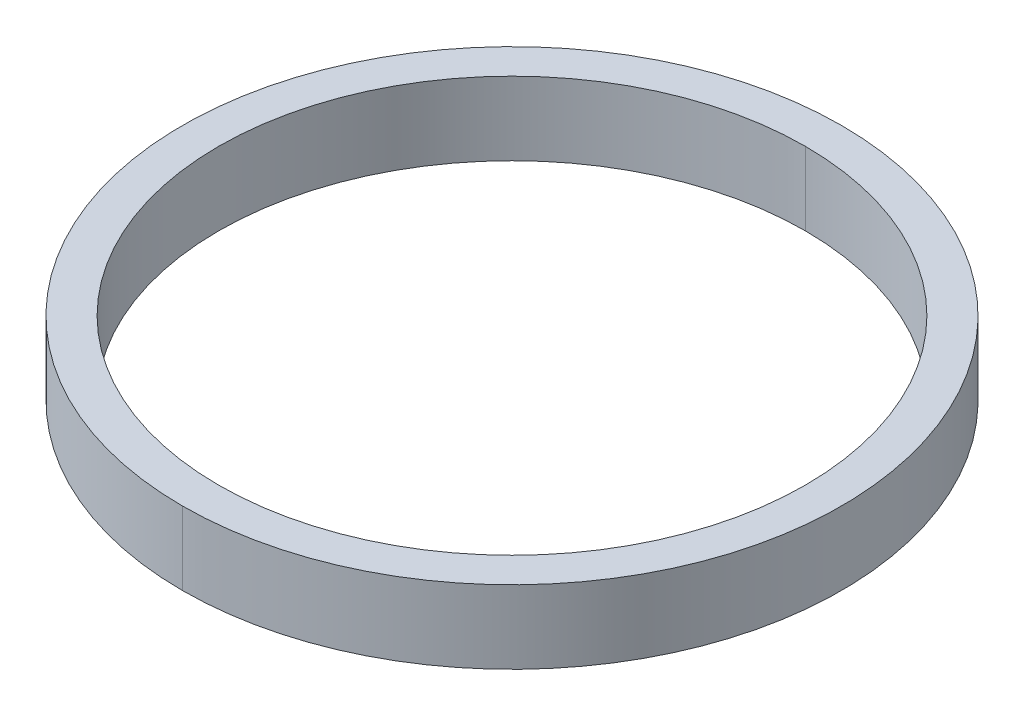
ISO-10303-21;
HEADER;
FILE_DESCRIPTION(('STEP AP214'),'2;1');
FILE_NAME('part.step','',(''),(''),'','','');
FILE_SCHEMA(('AUTOMOTIVE_DESIGN { 1 0 10303 214 1 1 1 1 }'));
ENDSEC;
DATA;
#1=APPLICATION_CONTEXT('core data for automotive mechanical design processes');
#2=APPLICATION_PROTOCOL_DEFINITION('international standard','automotive_design',2000,#1);
#3=PRODUCT_CONTEXT('',#1,'mechanical');
#4=PRODUCT('Part','Part','',(#3));
#5=PRODUCT_RELATED_PRODUCT_CATEGORY('part','',(#4));
#6=PRODUCT_DEFINITION_FORMATION('','',#4);
#7=PRODUCT_DEFINITION_CONTEXT('part definition',#1,'design');
#8=PRODUCT_DEFINITION('design','',#6,#7);
#9=PRODUCT_DEFINITION_SHAPE('','',#8);
#10=(LENGTH_UNIT() NAMED_UNIT(*) SI_UNIT(.MILLI.,.METRE.));
#11=(NAMED_UNIT(*) PLANE_ANGLE_UNIT() SI_UNIT($,.RADIAN.));
#12=(NAMED_UNIT(*) SI_UNIT($,.STERADIAN.) SOLID_ANGLE_UNIT());
#13=UNCERTAINTY_MEASURE_WITH_UNIT(LENGTH_MEASURE(1.E-05),#10,'distance_accuracy_value','');
#14=(GEOMETRIC_REPRESENTATION_CONTEXT(3) GLOBAL_UNCERTAINTY_ASSIGNED_CONTEXT((#13)) GLOBAL_UNIT_ASSIGNED_CONTEXT((#10,
#11,#12)) REPRESENTATION_CONTEXT('',''));
#15=CARTESIAN_POINT('',(0.,0.,0.));
#16=DIRECTION('',(0.,0.,1.));
#17=DIRECTION('',(1.,0.,0.));
#18=AXIS2_PLACEMENT_3D('',#15,#16,#17);
#19=CARTESIAN_POINT('',(0.,4.,0.));
#20=DIRECTION('',(0.,-1.,0.));
#21=DIRECTION('',(0.,0.,-1.));
#22=AXIS2_PLACEMENT_3D('',#19,#20,#21);
#23=CYLINDRICAL_SURFACE('',#22,16.025);
#24=CARTESIAN_POINT('',(0.,4.,0.));
#25=DIRECTION('',(0.,1.,0.));
#26=DIRECTION('',(0.,0.,1.));
#27=AXIS2_PLACEMENT_3D('',#24,#25,#26);
#28=CIRCLE('',#27,16.025);
#29=CARTESIAN_POINT('',(0.,4.,-16.025));
#30=VERTEX_POINT('',#29);
#31=CARTESIAN_POINT('',(0.,4.,16.025));
#32=VERTEX_POINT('',#31);
#33=EDGE_CURVE('E11',#30,#32,#28,.T.);
#34=ORIENTED_EDGE('',*,*,#33,.T.);
#35=DIRECTION('',(0.,-1.,0.));
#36=VECTOR('',#35,1.);
#37=CARTESIAN_POINT('',(0.,4.,16.025));
#38=LINE('',#37,#36);
#39=CARTESIAN_POINT('',(0.,0.,16.025));
#40=VERTEX_POINT('',#39);
#41=EDGE_CURVE('E27',#32,#40,#38,.T.);
#42=ORIENTED_EDGE('',*,*,#41,.T.);
#43=CARTESIAN_POINT('',(0.,0.,0.));
#44=DIRECTION('',(0.,1.,0.));
#45=DIRECTION('',(0.,0.,1.));
#46=AXIS2_PLACEMENT_3D('',#43,#44,#45);
#47=CIRCLE('',#46,16.025);
#48=CARTESIAN_POINT('',(0.,0.,-16.025));
#49=VERTEX_POINT('',#48);
#50=EDGE_CURVE('E20',#49,#40,#47,.T.);
#51=ORIENTED_EDGE('',*,*,#50,.F.);
#52=DIRECTION('',(0.,-1.,0.));
#53=VECTOR('',#52,1.);
#54=CARTESIAN_POINT('',(0.,4.,-16.025));
#55=LINE('',#54,#53);
#56=EDGE_CURVE('E55',#30,#49,#55,.T.);
#57=ORIENTED_EDGE('',*,*,#56,.F.);
#58=EDGE_LOOP('',(#34,#42,#51,#57));
#59=FACE_BOUND('',#58,.T.);
#60=ADVANCED_FACE('F16',(#59),#23,.F.);
#61=CARTESIAN_POINT('',(0.,4.,0.));
#62=DIRECTION('',(0.,-1.,0.));
#63=DIRECTION('',(0.,0.,-1.));
#64=AXIS2_PLACEMENT_3D('',#61,#62,#63);
#65=CYLINDRICAL_SURFACE('',#64,18.);
#66=CARTESIAN_POINT('',(0.,4.,0.));
#67=DIRECTION('',(0.,1.,0.));
#68=DIRECTION('',(0.,0.,1.));
#69=AXIS2_PLACEMENT_3D('',#66,#67,#68);
#70=CIRCLE('',#69,18.);
#71=CARTESIAN_POINT('',(0.,4.,18.));
#72=VERTEX_POINT('',#71);
#73=CARTESIAN_POINT('',(0.,4.,-18.));
#74=VERTEX_POINT('',#73);
#75=EDGE_CURVE('E68',#72,#74,#70,.T.);
#76=ORIENTED_EDGE('',*,*,#75,.F.);
#77=DIRECTION('',(0.,-1.,0.));
#78=VECTOR('',#77,1.);
#79=CARTESIAN_POINT('',(0.,4.,18.));
#80=LINE('',#79,#78);
#81=CARTESIAN_POINT('',(0.,0.,18.));
#82=VERTEX_POINT('',#81);
#83=EDGE_CURVE('E101',#72,#82,#80,.T.);
#84=ORIENTED_EDGE('',*,*,#83,.T.);
#85=CARTESIAN_POINT('',(0.,0.,0.));
#86=DIRECTION('',(0.,1.,0.));
#87=DIRECTION('',(0.,0.,1.));
#88=AXIS2_PLACEMENT_3D('',#85,#86,#87);
#89=CIRCLE('',#88,18.);
#90=CARTESIAN_POINT('',(0.,0.,-18.));
#91=VERTEX_POINT('',#90);
#92=EDGE_CURVE('E87',#82,#91,#89,.T.);
#93=ORIENTED_EDGE('',*,*,#92,.T.);
#94=DIRECTION('',(0.,-1.,0.));
#95=VECTOR('',#94,1.);
#96=CARTESIAN_POINT('',(0.,4.,-18.));
#97=LINE('',#96,#95);
#98=EDGE_CURVE('E83',#74,#91,#97,.T.);
#99=ORIENTED_EDGE('',*,*,#98,.F.);
#100=EDGE_LOOP('',(#76,#84,#93,#99));
#101=FACE_BOUND('',#100,.T.);
#102=ADVANCED_FACE('F18',(#101),#65,.T.);
#103=CARTESIAN_POINT('',(0.,4.,0.));
#104=DIRECTION('',(0.,1.,0.));
#105=DIRECTION('',(1.,0.,0.));
#106=AXIS2_PLACEMENT_3D('',#103,#104,#105);
#107=PLANE('',#106);
#108=CARTESIAN_POINT('',(0.,4.,0.));
#109=DIRECTION('',(0.,1.,0.));
#110=DIRECTION('',(0.,0.,1.));
#111=AXIS2_PLACEMENT_3D('',#108,#109,#110);
#112=CIRCLE('',#111,18.);
#113=EDGE_CURVE('E97',#74,#72,#112,.T.);
#114=ORIENTED_EDGE('',*,*,#113,.T.);
#115=ORIENTED_EDGE('',*,*,#75,.T.);
#116=EDGE_LOOP('',(#114,#115));
#117=FACE_BOUND('',#116,.T.);
#118=ORIENTED_EDGE('',*,*,#33,.F.);
#119=CARTESIAN_POINT('',(0.,4.,0.));
#120=DIRECTION('',(0.,1.,0.));
#121=DIRECTION('',(0.,0.,1.));
#122=AXIS2_PLACEMENT_3D('',#119,#120,#121);
#123=CIRCLE('',#122,16.025);
#124=EDGE_CURVE('E112',#32,#30,#123,.T.);
#125=ORIENTED_EDGE('',*,*,#124,.F.);
#126=EDGE_LOOP('',(#118,#125));
#127=FACE_BOUND('',#126,.T.);
#128=ADVANCED_FACE('F95',(#117,#127),#107,.T.);
#129=CARTESIAN_POINT('',(0.,0.,0.));
#130=DIRECTION('',(0.,1.,0.));
#131=DIRECTION('',(1.,0.,0.));
#132=AXIS2_PLACEMENT_3D('',#129,#130,#131);
#133=PLANE('',#132);
#134=CARTESIAN_POINT('',(0.,0.,0.));
#135=DIRECTION('',(0.,1.,0.));
#136=DIRECTION('',(0.,0.,1.));
#137=AXIS2_PLACEMENT_3D('',#134,#135,#136);
#138=CIRCLE('',#137,18.);
#139=EDGE_CURVE('E91',#91,#82,#138,.T.);
#140=ORIENTED_EDGE('',*,*,#139,.F.);
#141=ORIENTED_EDGE('',*,*,#92,.F.);
#142=EDGE_LOOP('',(#140,#141));
#143=FACE_BOUND('',#142,.T.);
#144=ORIENTED_EDGE('',*,*,#50,.T.);
#145=CARTESIAN_POINT('',(0.,0.,0.));
#146=DIRECTION('',(0.,1.,0.));
#147=DIRECTION('',(0.,0.,1.));
#148=AXIS2_PLACEMENT_3D('',#145,#146,#147);
#149=CIRCLE('',#148,16.025);
#150=EDGE_CURVE('E90',#40,#49,#149,.T.);
#151=ORIENTED_EDGE('',*,*,#150,.T.);
#152=EDGE_LOOP('',(#144,#151));
#153=FACE_BOUND('',#152,.T.);
#154=ADVANCED_FACE('F179',(#143,#153),#133,.F.);
#155=CARTESIAN_POINT('',(0.,4.,0.));
#156=DIRECTION('',(0.,-1.,0.));
#157=DIRECTION('',(0.,0.,-1.));
#158=AXIS2_PLACEMENT_3D('',#155,#156,#157);
#159=CYLINDRICAL_SURFACE('',#158,18.);
#160=ORIENTED_EDGE('',*,*,#83,.F.);
#161=ORIENTED_EDGE('',*,*,#113,.F.);
#162=ORIENTED_EDGE('',*,*,#98,.T.);
#163=ORIENTED_EDGE('',*,*,#139,.T.);
#164=EDGE_LOOP('',(#160,#161,#162,#163));
#165=FACE_BOUND('',#164,.T.);
#166=ADVANCED_FACE('F100',(#165),#159,.T.);
#167=CARTESIAN_POINT('',(0.,4.,0.));
#168=DIRECTION('',(0.,-1.,0.));
#169=DIRECTION('',(0.,0.,-1.));
#170=AXIS2_PLACEMENT_3D('',#167,#168,#169);
#171=CYLINDRICAL_SURFACE('',#170,16.025);
#172=ORIENTED_EDGE('',*,*,#41,.F.);
#173=ORIENTED_EDGE('',*,*,#124,.T.);
#174=ORIENTED_EDGE('',*,*,#56,.T.);
#175=ORIENTED_EDGE('',*,*,#150,.F.);
#176=EDGE_LOOP('',(#172,#173,#174,#175));
#177=FACE_BOUND('',#176,.T.);
#178=ADVANCED_FACE('F164',(#177),#171,.F.);
#179=CLOSED_SHELL('',(#60,#102,#128,#154,#166,#178));
#180=MANIFOLD_SOLID_BREP('B1',#179);
#181=ADVANCED_BREP_SHAPE_REPRESENTATION('',(#18,#180),#14);
#182=SHAPE_DEFINITION_REPRESENTATION(#9,#181);
ENDSEC;
END-ISO-10303-21;
